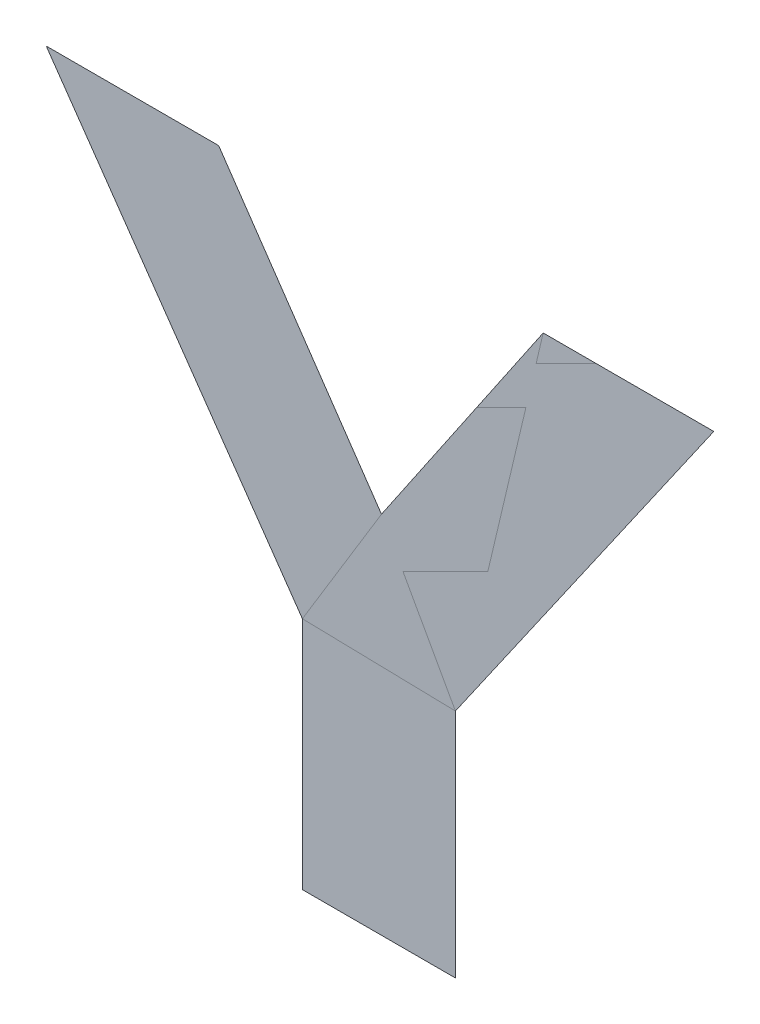
ISO-10303-21;
HEADER;
FILE_DESCRIPTION(('STEP AP214'),'2;1');
FILE_NAME('part.step','',(''),(''),'','','');
FILE_SCHEMA(('AUTOMOTIVE_DESIGN { 1 0 10303 214 1 1 1 1 }'));
ENDSEC;
DATA;
#1=APPLICATION_CONTEXT('core data for automotive mechanical design processes');
#2=APPLICATION_PROTOCOL_DEFINITION('international standard','automotive_design',2000,#1);
#3=PRODUCT_CONTEXT('',#1,'mechanical');
#4=PRODUCT('Part','Part','',(#3));
#5=PRODUCT_RELATED_PRODUCT_CATEGORY('part','',(#4));
#6=PRODUCT_DEFINITION_FORMATION('','',#4);
#7=PRODUCT_DEFINITION_CONTEXT('part definition',#1,'design');
#8=PRODUCT_DEFINITION('design','',#6,#7);
#9=PRODUCT_DEFINITION_SHAPE('','',#8);
#10=(LENGTH_UNIT() NAMED_UNIT(*) SI_UNIT(.MILLI.,.METRE.));
#11=(NAMED_UNIT(*) PLANE_ANGLE_UNIT() SI_UNIT($,.RADIAN.));
#12=(NAMED_UNIT(*) SI_UNIT($,.STERADIAN.) SOLID_ANGLE_UNIT());
#13=UNCERTAINTY_MEASURE_WITH_UNIT(LENGTH_MEASURE(1.E-05),#10,'distance_accuracy_value','');
#14=(GEOMETRIC_REPRESENTATION_CONTEXT(3) GLOBAL_UNCERTAINTY_ASSIGNED_CONTEXT((#13)) GLOBAL_UNIT_ASSIGNED_CONTEXT((#10,
#11,#12)) REPRESENTATION_CONTEXT('',''));
#15=CARTESIAN_POINT('',(0.,0.,0.));
#16=DIRECTION('',(0.,0.,1.));
#17=DIRECTION('',(1.,0.,0.));
#18=AXIS2_PLACEMENT_3D('',#15,#16,#17);
#19=CARTESIAN_POINT('',(0.129984975226,0.773280378382,0.00045));
#20=DIRECTION('',(0.,0.,1.));
#21=DIRECTION('',(1.,0.,0.));
#22=AXIS2_PLACEMENT_3D('',#19,#20,#21);
#23=PLANE('',#22);
#24=CARTESIAN_POINT('',(0.130177980301,0.820965686872,0.00045));
#25=DIRECTION('',(-0.564857791520084,0.825188266614991,0.));
#26=VECTOR('',#25,1.);
#27=LINE('',#24,#26);
#28=CARTESIAN_POINT('',(0.130177980301,0.820965686872,0.000225));
#29=VERTEX_POINT('',#28);
#30=CARTESIAN_POINT('',(0.108886087401,0.852070542747,0.000225));
#31=VERTEX_POINT('',#30);
#32=EDGE_CURVE('E149',#29,#31,#27,.T.);
#33=ORIENTED_EDGE('',*,*,#32,.T.);
#34=CARTESIAN_POINT('',(0.108886087401,0.852070542747,0.00045));
#35=DIRECTION('',(-1.,0.,0.));
#36=VECTOR('',#35,1.);
#37=LINE('',#34,#36);
#38=CARTESIAN_POINT('',(0.086334564051,0.852070542747,0.000225));
#39=VERTEX_POINT('',#38);
#40=EDGE_CURVE('E28',#31,#39,#37,.T.);
#41=ORIENTED_EDGE('',*,*,#40,.T.);
#42=CARTESIAN_POINT('',(0.086334564051,0.852070542747,0.00045));
#43=DIRECTION('',(0.571460408211035,-0.820629637441445,0.));
#44=VECTOR('',#43,1.);
#45=LINE('',#42,#44);
#46=CARTESIAN_POINT('',(0.119836789401,0.803960614837,0.000225));
#47=VERTEX_POINT('',#46);
#48=EDGE_CURVE('E11',#39,#47,#45,.T.);
#49=ORIENTED_EDGE('',*,*,#48,.T.);
#50=CARTESIAN_POINT('',(0.119836789401,0.803960614837,0.00045));
#51=DIRECTION('',(0.,-1.,0.));
#52=VECTOR('',#51,1.);
#53=LINE('',#50,#52);
#54=CARTESIAN_POINT('',(0.119836789401,0.773280378382,0.000225));
#55=VERTEX_POINT('',#54);
#56=EDGE_CURVE('E59',#47,#55,#53,.T.);
#57=ORIENTED_EDGE('',*,*,#56,.T.);
#58=CARTESIAN_POINT('',(0.119836789401,0.773280378382,0.00045));
#59=DIRECTION('',(1.,0.,0.));
#60=VECTOR('',#59,1.);
#61=LINE('',#58,#60);
#62=CARTESIAN_POINT('',(0.139848725501,0.773280378382,0.000225));
#63=VERTEX_POINT('',#62);
#64=EDGE_CURVE('E56',#55,#63,#61,.T.);
#65=ORIENTED_EDGE('',*,*,#64,.T.);
#66=CARTESIAN_POINT('',(0.139848725501,0.773280378382,0.00045));
#67=DIRECTION('',(0.,1.,0.));
#68=VECTOR('',#67,1.);
#69=LINE('',#66,#68);
#70=CARTESIAN_POINT('',(0.139848725501,0.803513647862,0.000225));
#71=VERTEX_POINT('',#70);
#72=EDGE_CURVE('E143',#63,#71,#69,.T.);
#73=ORIENTED_EDGE('',*,*,#72,.T.);
#74=CARTESIAN_POINT('',(0.139848725501,0.803513647862,0.00045));
#75=DIRECTION('',(0.571155066154539,0.820842183617535,0.));
#76=VECTOR('',#75,1.);
#77=LINE('',#74,#76);
#78=CARTESIAN_POINT('',(0.173635386401,0.852070542747,0.000225));
#79=VERTEX_POINT('',#78);
#80=EDGE_CURVE('E144',#71,#79,#77,.T.);
#81=ORIENTED_EDGE('',*,*,#80,.T.);
#82=CARTESIAN_POINT('',(0.173635386401,0.852070542747,0.00045));
#83=DIRECTION('',(-1.,0.,0.));
#84=VECTOR('',#83,1.);
#85=LINE('',#82,#84);
#86=CARTESIAN_POINT('',(0.151327658601,0.852070542747,0.000225));
#87=VERTEX_POINT('',#86);
#88=EDGE_CURVE('E145',#79,#87,#85,.T.);
#89=ORIENTED_EDGE('',*,*,#88,.T.);
#90=CARTESIAN_POINT('',(0.151327658601,0.852070542747,0.00045));
#91=DIRECTION('',(-0.562280503007886,-0.826946573810666,0.));
#92=VECTOR('',#91,1.);
#93=LINE('',#90,#92);
#94=EDGE_CURVE('E147',#87,#29,#93,.T.);
#95=ORIENTED_EDGE('',*,*,#94,.T.);
#96=EDGE_LOOP('',(#33,#41,#49,#57,#65,#73,#81,#89,#95));
#97=FACE_BOUND('',#96,.T.);
#98=ADVANCED_FACE('F17',(#97),#23,.T.);
#99=CARTESIAN_POINT('',(0.129984975226,0.773280378382,0.));
#100=DIRECTION('',(0.,0.,1.));
#101=DIRECTION('',(1.,0.,0.));
#102=AXIS2_PLACEMENT_3D('',#99,#100,#101);
#103=PLANE('',#102);
#104=ORIENTED_EDGE('',*,*,#40,.F.);
#105=ORIENTED_EDGE('',*,*,#32,.F.);
#106=ORIENTED_EDGE('',*,*,#94,.F.);
#107=ORIENTED_EDGE('',*,*,#88,.F.);
#108=ORIENTED_EDGE('',*,*,#80,.F.);
#109=ORIENTED_EDGE('',*,*,#72,.F.);
#110=ORIENTED_EDGE('',*,*,#64,.F.);
#111=ORIENTED_EDGE('',*,*,#56,.F.);
#112=ORIENTED_EDGE('',*,*,#48,.F.);
#113=EDGE_LOOP('',(#104,#105,#106,#107,#108,#109,#110,#111,#112));
#114=FACE_BOUND('',#113,.T.);
#115=ADVANCED_FACE('F61',(#114),#103,.F.);
#116=CLOSED_SHELL('',(#98,#115));
#117=MANIFOLD_SOLID_BREP('B1',#116);
#118=ADVANCED_BREP_SHAPE_REPRESENTATION('',(#18,#117),#14);
#119=SHAPE_DEFINITION_REPRESENTATION(#9,#118);
ENDSEC;
END-ISO-10303-21;
